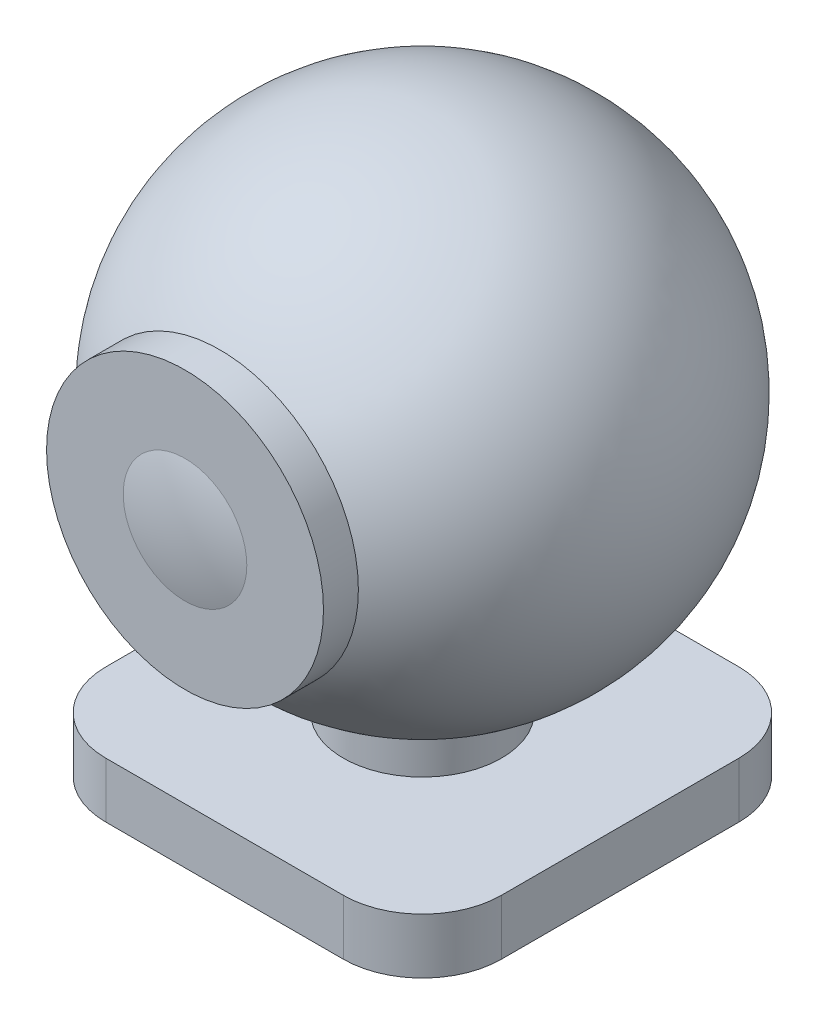
ISO-10303-21;
HEADER;
FILE_DESCRIPTION(('STEP AP214'),'2;1');
FILE_NAME('part.step','',(''),(''),'','','');
FILE_SCHEMA(('AUTOMOTIVE_DESIGN { 1 0 10303 214 1 1 1 1 }'));
ENDSEC;
DATA;
#1=APPLICATION_CONTEXT('core data for automotive mechanical design processes');
#2=APPLICATION_PROTOCOL_DEFINITION('international standard','automotive_design',2000,#1);
#3=PRODUCT_CONTEXT('',#1,'mechanical');
#4=PRODUCT('Part','Part','',(#3));
#5=PRODUCT_RELATED_PRODUCT_CATEGORY('part','',(#4));
#6=PRODUCT_DEFINITION_FORMATION('','',#4);
#7=PRODUCT_DEFINITION_CONTEXT('part definition',#1,'design');
#8=PRODUCT_DEFINITION('design','',#6,#7);
#9=PRODUCT_DEFINITION_SHAPE('','',#8);
#10=(LENGTH_UNIT() NAMED_UNIT(*) SI_UNIT(.MILLI.,.METRE.));
#11=(NAMED_UNIT(*) PLANE_ANGLE_UNIT() SI_UNIT($,.RADIAN.));
#12=(NAMED_UNIT(*) SI_UNIT($,.STERADIAN.) SOLID_ANGLE_UNIT());
#13=UNCERTAINTY_MEASURE_WITH_UNIT(LENGTH_MEASURE(1.E-05),#10,'distance_accuracy_value','');
#14=(GEOMETRIC_REPRESENTATION_CONTEXT(3) GLOBAL_UNCERTAINTY_ASSIGNED_CONTEXT((#13)) GLOBAL_UNIT_ASSIGNED_CONTEXT((#10,
#11,#12)) REPRESENTATION_CONTEXT('',''));
#15=CARTESIAN_POINT('',(0.,0.,0.));
#16=DIRECTION('',(0.,0.,1.));
#17=DIRECTION('',(1.,0.,0.));
#18=AXIS2_PLACEMENT_3D('',#15,#16,#17);
#19=CARTESIAN_POINT('',(0.,0.,0.));
#20=DIRECTION('',(0.,1.,0.));
#21=DIRECTION('',(-1.,0.,0.));
#22=AXIS2_PLACEMENT_3D('',#19,#20,#21);
#23=SPHERICAL_SURFACE('',#22,31.);
#24=CARTESIAN_POINT('',(0.,0.,25.588083163848));
#25=DIRECTION('',(0.,0.,-1.));
#26=DIRECTION('',(-1.,0.,0.));
#27=AXIS2_PLACEMENT_3D('',#24,#25,#26);
#28=CIRCLE('',#27,17.5);
#29=CARTESIAN_POINT('',(-17.5,0.,25.588083163848));
#30=VERTEX_POINT('',#29);
#31=EDGE_CURVE('E151',#30,#30,#28,.F.);
#32=ORIENTED_EDGE('',*,*,#31,.F.);
#33=EDGE_LOOP('',(#32));
#34=FACE_BOUND('',#33,.T.);
#35=CARTESIAN_POINT('',(0.,-29.3428015022424,0.));
#36=DIRECTION('',(0.,1.,0.));
#37=DIRECTION('',(0.,0.,1.));
#38=AXIS2_PLACEMENT_3D('',#35,#36,#37);
#39=CIRCLE('',#38,10.);
#40=CARTESIAN_POINT('',(0.,-29.3428015022424,10.));
#41=VERTEX_POINT('',#40);
#42=EDGE_CURVE('E148',#41,#41,#39,.F.);
#43=ORIENTED_EDGE('',*,*,#42,.F.);
#44=EDGE_LOOP('',(#43));
#45=FACE_BOUND('',#44,.T.);
#46=ADVANCED_FACE('F33',(#34,#45),#23,.T.);
#47=CARTESIAN_POINT('',(0.,0.,30.));
#48=DIRECTION('',(0.,0.,1.));
#49=DIRECTION('',(1.,0.,0.));
#50=AXIS2_PLACEMENT_3D('',#47,#48,#49);
#51=PLANE('',#50);
#52=CARTESIAN_POINT('',(0.,0.,30.));
#53=DIRECTION('',(0.,0.,1.));
#54=DIRECTION('',(1.,0.,0.));
#55=AXIS2_PLACEMENT_3D('',#52,#53,#54);
#56=CIRCLE('',#55,17.5);
#57=CARTESIAN_POINT('',(17.5,0.,30.));
#58=VERTEX_POINT('',#57);
#59=EDGE_CURVE('E152',#58,#58,#56,.T.);
#60=ORIENTED_EDGE('',*,*,#59,.T.);
#61=EDGE_LOOP('',(#60));
#62=FACE_BOUND('',#61,.T.);
#63=CARTESIAN_POINT('',(0.,0.,30.));
#64=DIRECTION('',(0.,0.,1.));
#65=DIRECTION('',(1.,0.,0.));
#66=AXIS2_PLACEMENT_3D('',#63,#64,#65);
#67=CIRCLE('',#66,7.81024967590665);
#68=CARTESIAN_POINT('',(7.81024967590665,0.,30.));
#69=VERTEX_POINT('',#68);
#70=EDGE_CURVE('E161',#69,#69,#67,.T.);
#71=ORIENTED_EDGE('',*,*,#70,.F.);
#72=EDGE_LOOP('',(#71));
#73=FACE_BOUND('',#72,.T.);
#74=ADVANCED_FACE('F217',(#62,#73),#51,.T.);
#75=CARTESIAN_POINT('',(0.,0.,30.));
#76=DIRECTION('',(0.,0.,-1.));
#77=DIRECTION('',(-1.,0.,0.));
#78=AXIS2_PLACEMENT_3D('',#75,#76,#77);
#79=CYLINDRICAL_SURFACE('',#78,17.5);
#80=ORIENTED_EDGE('',*,*,#59,.F.);
#81=EDGE_LOOP('',(#80));
#82=FACE_BOUND('',#81,.T.);
#83=ORIENTED_EDGE('',*,*,#31,.T.);
#84=EDGE_LOOP('',(#83));
#85=FACE_BOUND('',#84,.T.);
#86=ADVANCED_FACE('F224',(#82,#85),#79,.T.);
#87=CARTESIAN_POINT('',(0.,0.,0.));
#88=DIRECTION('',(0.,0.,1.));
#89=DIRECTION('',(1.,0.,0.));
#90=AXIS2_PLACEMENT_3D('',#87,#88,#89);
#91=SPHERICAL_SURFACE('',#90,31.);
#92=ORIENTED_EDGE('',*,*,#70,.T.);
#93=EDGE_LOOP('',(#92));
#94=FACE_BOUND('',#93,.T.);
#95=ADVANCED_FACE('F220',(#94),#91,.T.);
#96=CARTESIAN_POINT('',(0.,-28.,0.));
#97=DIRECTION('',(0.,-1.,0.));
#98=DIRECTION('',(0.,0.,-1.));
#99=AXIS2_PLACEMENT_3D('',#96,#97,#98);
#100=CYLINDRICAL_SURFACE('',#99,10.);
#101=CARTESIAN_POINT('',(0.,-35.,0.));
#102=DIRECTION('',(0.,-1.,0.));
#103=DIRECTION('',(0.,0.,-1.));
#104=AXIS2_PLACEMENT_3D('',#101,#102,#103);
#105=CIRCLE('',#104,10.);
#106=CARTESIAN_POINT('',(0.,-35.,-10.));
#107=VERTEX_POINT('',#106);
#108=EDGE_CURVE('E141',#107,#107,#105,.T.);
#109=ORIENTED_EDGE('',*,*,#108,.F.);
#110=EDGE_LOOP('',(#109));
#111=FACE_BOUND('',#110,.T.);
#112=ORIENTED_EDGE('',*,*,#42,.T.);
#113=EDGE_LOOP('',(#112));
#114=FACE_BOUND('',#113,.T.);
#115=ADVANCED_FACE('F232',(#111,#114),#100,.T.);
#116=CARTESIAN_POINT('',(25.,-35.,-25.));
#117=DIRECTION('',(0.,-1.,0.));
#118=DIRECTION('',(0.,0.,-1.));
#119=AXIS2_PLACEMENT_3D('',#116,#117,#118);
#120=PLANE('',#119);
#121=DIRECTION('',(0.,0.,1.));
#122=VECTOR('',#121,1.);
#123=CARTESIAN_POINT('',(25.,-35.,25.));
#124=LINE('',#123,#122);
#125=CARTESIAN_POINT('',(25.,-35.,-15.));
#126=VERTEX_POINT('',#125);
#127=CARTESIAN_POINT('',(25.,-35.,15.));
#128=VERTEX_POINT('',#127);
#129=EDGE_CURVE('E118',#126,#128,#124,.T.);
#130=ORIENTED_EDGE('',*,*,#129,.F.);
#131=CARTESIAN_POINT('',(15.,-35.,-15.));
#132=DIRECTION('',(0.,-1.,0.));
#133=DIRECTION('',(0.,0.,-1.));
#134=AXIS2_PLACEMENT_3D('',#131,#132,#133);
#135=CIRCLE('',#134,10.);
#136=CARTESIAN_POINT('',(15.,-35.,-25.));
#137=VERTEX_POINT('',#136);
#138=EDGE_CURVE('E101',#126,#137,#135,.F.);
#139=ORIENTED_EDGE('',*,*,#138,.T.);
#140=DIRECTION('',(1.,0.,0.));
#141=VECTOR('',#140,1.);
#142=CARTESIAN_POINT('',(-25.,-35.,-25.));
#143=LINE('',#142,#141);
#144=CARTESIAN_POINT('',(-15.,-35.,-25.));
#145=VERTEX_POINT('',#144);
#146=EDGE_CURVE('E139',#145,#137,#143,.T.);
#147=ORIENTED_EDGE('',*,*,#146,.F.);
#148=CARTESIAN_POINT('',(-15.,-35.,-15.));
#149=DIRECTION('',(0.,-1.,0.));
#150=DIRECTION('',(0.,0.,-1.));
#151=AXIS2_PLACEMENT_3D('',#148,#149,#150);
#152=CIRCLE('',#151,10.);
#153=CARTESIAN_POINT('',(-25.,-35.,-15.));
#154=VERTEX_POINT('',#153);
#155=EDGE_CURVE('E112',#145,#154,#152,.F.);
#156=ORIENTED_EDGE('',*,*,#155,.T.);
#157=DIRECTION('',(0.,0.,-1.));
#158=VECTOR('',#157,1.);
#159=CARTESIAN_POINT('',(-25.,-35.,25.));
#160=LINE('',#159,#158);
#161=CARTESIAN_POINT('',(-25.,-35.,15.));
#162=VERTEX_POINT('',#161);
#163=EDGE_CURVE('E132',#162,#154,#160,.T.);
#164=ORIENTED_EDGE('',*,*,#163,.F.);
#165=CARTESIAN_POINT('',(-15.,-35.,15.));
#166=DIRECTION('',(0.,-1.,0.));
#167=DIRECTION('',(0.,0.,-1.));
#168=AXIS2_PLACEMENT_3D('',#165,#166,#167);
#169=CIRCLE('',#168,10.);
#170=CARTESIAN_POINT('',(-15.,-35.,25.));
#171=VERTEX_POINT('',#170);
#172=EDGE_CURVE('E122',#162,#171,#169,.F.);
#173=ORIENTED_EDGE('',*,*,#172,.T.);
#174=DIRECTION('',(-1.,0.,0.));
#175=VECTOR('',#174,1.);
#176=CARTESIAN_POINT('',(-25.,-35.,25.));
#177=LINE('',#176,#175);
#178=CARTESIAN_POINT('',(15.,-35.,25.));
#179=VERTEX_POINT('',#178);
#180=EDGE_CURVE('E129',#179,#171,#177,.T.);
#181=ORIENTED_EDGE('',*,*,#180,.F.);
#182=CARTESIAN_POINT('',(15.,-35.,15.));
#183=DIRECTION('',(0.,-1.,0.));
#184=DIRECTION('',(0.,0.,-1.));
#185=AXIS2_PLACEMENT_3D('',#182,#183,#184);
#186=CIRCLE('',#185,10.);
#187=EDGE_CURVE('E128',#179,#128,#186,.F.);
#188=ORIENTED_EDGE('',*,*,#187,.T.);
#189=EDGE_LOOP('',(#130,#139,#147,#156,#164,#173,#181,#188));
#190=FACE_BOUND('',#189,.T.);
#191=ORIENTED_EDGE('',*,*,#108,.T.);
#192=EDGE_LOOP('',(#191));
#193=FACE_BOUND('',#192,.T.);
#194=ADVANCED_FACE('F125',(#190,#193),#120,.F.);
#195=CARTESIAN_POINT('',(25.,-42.,25.));
#196=DIRECTION('',(-1.,0.,0.));
#197=DIRECTION('',(0.,0.,1.));
#198=AXIS2_PLACEMENT_3D('',#195,#196,#197);
#199=PLANE('',#198);
#200=DIRECTION('',(0.,0.,1.));
#201=VECTOR('',#200,1.);
#202=CARTESIAN_POINT('',(25.,-42.,25.));
#203=LINE('',#202,#201);
#204=CARTESIAN_POINT('',(25.,-42.,-15.));
#205=VERTEX_POINT('',#204);
#206=CARTESIAN_POINT('',(25.,-42.,15.));
#207=VERTEX_POINT('',#206);
#208=EDGE_CURVE('E121',#205,#207,#203,.T.);
#209=ORIENTED_EDGE('',*,*,#208,.F.);
#210=DIRECTION('',(0.,1.,0.));
#211=VECTOR('',#210,1.);
#212=CARTESIAN_POINT('',(25.,-42.,-15.));
#213=LINE('',#212,#211);
#214=EDGE_CURVE('E105',#205,#126,#213,.T.);
#215=ORIENTED_EDGE('',*,*,#214,.T.);
#216=ORIENTED_EDGE('',*,*,#129,.T.);
#217=DIRECTION('',(0.,1.,0.));
#218=VECTOR('',#217,1.);
#219=CARTESIAN_POINT('',(25.,-42.,15.));
#220=LINE('',#219,#218);
#221=EDGE_CURVE('E123',#128,#207,#220,.F.);
#222=ORIENTED_EDGE('',*,*,#221,.T.);
#223=EDGE_LOOP('',(#209,#215,#216,#222));
#224=FACE_BOUND('',#223,.T.);
#225=ADVANCED_FACE('F117',(#224),#199,.F.);
#226=CARTESIAN_POINT('',(-25.,-42.,25.));
#227=DIRECTION('',(0.,0.,-1.));
#228=DIRECTION('',(-1.,0.,0.));
#229=AXIS2_PLACEMENT_3D('',#226,#227,#228);
#230=PLANE('',#229);
#231=DIRECTION('',(-1.,0.,0.));
#232=VECTOR('',#231,1.);
#233=CARTESIAN_POINT('',(-25.,-42.,25.));
#234=LINE('',#233,#232);
#235=CARTESIAN_POINT('',(15.,-42.,25.));
#236=VERTEX_POINT('',#235);
#237=CARTESIAN_POINT('',(-15.,-42.,25.));
#238=VERTEX_POINT('',#237);
#239=EDGE_CURVE('E189',#236,#238,#234,.T.);
#240=ORIENTED_EDGE('',*,*,#239,.F.);
#241=DIRECTION('',(0.,1.,0.));
#242=VECTOR('',#241,1.);
#243=CARTESIAN_POINT('',(15.,-42.,25.));
#244=LINE('',#243,#242);
#245=EDGE_CURVE('E12',#236,#179,#244,.T.);
#246=ORIENTED_EDGE('',*,*,#245,.T.);
#247=ORIENTED_EDGE('',*,*,#180,.T.);
#248=DIRECTION('',(0.,1.,0.));
#249=VECTOR('',#248,1.);
#250=CARTESIAN_POINT('',(-15.,-42.,25.));
#251=LINE('',#250,#249);
#252=EDGE_CURVE('E42',#171,#238,#251,.F.);
#253=ORIENTED_EDGE('',*,*,#252,.T.);
#254=EDGE_LOOP('',(#240,#246,#247,#253));
#255=FACE_BOUND('',#254,.T.);
#256=ADVANCED_FACE('F188',(#255),#230,.F.);
#257=CARTESIAN_POINT('',(-25.,-42.,25.));
#258=DIRECTION('',(1.,0.,0.));
#259=DIRECTION('',(0.,0.,-1.));
#260=AXIS2_PLACEMENT_3D('',#257,#258,#259);
#261=PLANE('',#260);
#262=ORIENTED_EDGE('',*,*,#163,.T.);
#263=DIRECTION('',(0.,1.,0.));
#264=VECTOR('',#263,1.);
#265=CARTESIAN_POINT('',(-25.,-42.,-15.));
#266=LINE('',#265,#264);
#267=CARTESIAN_POINT('',(-25.,-42.,-15.));
#268=VERTEX_POINT('',#267);
#269=EDGE_CURVE('E49',#154,#268,#266,.F.);
#270=ORIENTED_EDGE('',*,*,#269,.T.);
#271=DIRECTION('',(0.,0.,-1.));
#272=VECTOR('',#271,1.);
#273=CARTESIAN_POINT('',(-25.,-42.,25.));
#274=LINE('',#273,#272);
#275=CARTESIAN_POINT('',(-25.,-42.,15.));
#276=VERTEX_POINT('',#275);
#277=EDGE_CURVE('E195',#276,#268,#274,.T.);
#278=ORIENTED_EDGE('',*,*,#277,.F.);
#279=DIRECTION('',(0.,1.,0.));
#280=VECTOR('',#279,1.);
#281=CARTESIAN_POINT('',(-25.,-42.,15.));
#282=LINE('',#281,#280);
#283=EDGE_CURVE('E182',#276,#162,#282,.T.);
#284=ORIENTED_EDGE('',*,*,#283,.T.);
#285=EDGE_LOOP('',(#262,#270,#278,#284));
#286=FACE_BOUND('',#285,.T.);
#287=ADVANCED_FACE('F199',(#286),#261,.F.);
#288=CARTESIAN_POINT('',(-25.,-42.,-25.));
#289=DIRECTION('',(0.,0.,1.));
#290=DIRECTION('',(1.,0.,0.));
#291=AXIS2_PLACEMENT_3D('',#288,#289,#290);
#292=PLANE('',#291);
#293=ORIENTED_EDGE('',*,*,#146,.T.);
#294=DIRECTION('',(0.,1.,0.));
#295=VECTOR('',#294,1.);
#296=CARTESIAN_POINT('',(15.,-42.,-25.));
#297=LINE('',#296,#295);
#298=CARTESIAN_POINT('',(15.,-42.,-25.));
#299=VERTEX_POINT('',#298);
#300=EDGE_CURVE('E106',#137,#299,#297,.F.);
#301=ORIENTED_EDGE('',*,*,#300,.T.);
#302=DIRECTION('',(1.,0.,0.));
#303=VECTOR('',#302,1.);
#304=CARTESIAN_POINT('',(-25.,-42.,-25.));
#305=LINE('',#304,#303);
#306=CARTESIAN_POINT('',(-15.,-42.,-25.));
#307=VERTEX_POINT('',#306);
#308=EDGE_CURVE('E135',#307,#299,#305,.T.);
#309=ORIENTED_EDGE('',*,*,#308,.F.);
#310=DIRECTION('',(0.,1.,0.));
#311=VECTOR('',#310,1.);
#312=CARTESIAN_POINT('',(-15.,-42.,-25.));
#313=LINE('',#312,#311);
#314=EDGE_CURVE('E111',#307,#145,#313,.T.);
#315=ORIENTED_EDGE('',*,*,#314,.T.);
#316=EDGE_LOOP('',(#293,#301,#309,#315));
#317=FACE_BOUND('',#316,.T.);
#318=ADVANCED_FACE('F206',(#317),#292,.F.);
#319=CARTESIAN_POINT('',(25.,-42.,-25.));
#320=DIRECTION('',(0.,-1.,0.));
#321=DIRECTION('',(0.,0.,-1.));
#322=AXIS2_PLACEMENT_3D('',#319,#320,#321);
#323=PLANE('',#322);
#324=ORIENTED_EDGE('',*,*,#308,.T.);
#325=CARTESIAN_POINT('',(15.,-42.,-15.));
#326=DIRECTION('',(0.,-1.,0.));
#327=DIRECTION('',(0.,0.,-1.));
#328=AXIS2_PLACEMENT_3D('',#325,#326,#327);
#329=CIRCLE('',#328,10.);
#330=EDGE_CURVE('E180',#299,#205,#329,.T.);
#331=ORIENTED_EDGE('',*,*,#330,.T.);
#332=ORIENTED_EDGE('',*,*,#208,.T.);
#333=CARTESIAN_POINT('',(15.,-42.,15.));
#334=DIRECTION('',(0.,-1.,0.));
#335=DIRECTION('',(0.,0.,-1.));
#336=AXIS2_PLACEMENT_3D('',#333,#334,#335);
#337=CIRCLE('',#336,10.);
#338=EDGE_CURVE('E176',#207,#236,#337,.T.);
#339=ORIENTED_EDGE('',*,*,#338,.T.);
#340=ORIENTED_EDGE('',*,*,#239,.T.);
#341=CARTESIAN_POINT('',(-15.,-42.,15.));
#342=DIRECTION('',(0.,-1.,0.));
#343=DIRECTION('',(0.,0.,-1.));
#344=AXIS2_PLACEMENT_3D('',#341,#342,#343);
#345=CIRCLE('',#344,10.);
#346=EDGE_CURVE('E56',#238,#276,#345,.T.);
#347=ORIENTED_EDGE('',*,*,#346,.T.);
#348=ORIENTED_EDGE('',*,*,#277,.T.);
#349=CARTESIAN_POINT('',(-15.,-42.,-15.));
#350=DIRECTION('',(0.,-1.,0.));
#351=DIRECTION('',(0.,0.,-1.));
#352=AXIS2_PLACEMENT_3D('',#349,#350,#351);
#353=CIRCLE('',#352,10.);
#354=EDGE_CURVE('E178',#268,#307,#353,.T.);
#355=ORIENTED_EDGE('',*,*,#354,.T.);
#356=EDGE_LOOP('',(#324,#331,#332,#339,#340,#347,#348,#355));
#357=FACE_BOUND('',#356,.T.);
#358=ADVANCED_FACE('F193',(#357),#323,.T.);
#359=CARTESIAN_POINT('',(15.,-42.,-15.));
#360=DIRECTION('',(0.,1.,0.));
#361=DIRECTION('',(0.,0.,1.));
#362=AXIS2_PLACEMENT_3D('',#359,#360,#361);
#363=CYLINDRICAL_SURFACE('',#362,10.);
#364=ORIENTED_EDGE('',*,*,#330,.F.);
#365=ORIENTED_EDGE('',*,*,#300,.F.);
#366=ORIENTED_EDGE('',*,*,#138,.F.);
#367=ORIENTED_EDGE('',*,*,#214,.F.);
#368=EDGE_LOOP('',(#364,#365,#366,#367));
#369=FACE_BOUND('',#368,.T.);
#370=ADVANCED_FACE('F104',(#369),#363,.T.);
#371=CARTESIAN_POINT('',(-15.,-42.,-15.));
#372=DIRECTION('',(0.,1.,0.));
#373=DIRECTION('',(0.,0.,1.));
#374=AXIS2_PLACEMENT_3D('',#371,#372,#373);
#375=CYLINDRICAL_SURFACE('',#374,10.);
#376=ORIENTED_EDGE('',*,*,#354,.F.);
#377=ORIENTED_EDGE('',*,*,#269,.F.);
#378=ORIENTED_EDGE('',*,*,#155,.F.);
#379=ORIENTED_EDGE('',*,*,#314,.F.);
#380=EDGE_LOOP('',(#376,#377,#378,#379));
#381=FACE_BOUND('',#380,.T.);
#382=ADVANCED_FACE('F203',(#381),#375,.T.);
#383=CARTESIAN_POINT('',(15.,-42.,15.));
#384=DIRECTION('',(0.,1.,0.));
#385=DIRECTION('',(0.,0.,1.));
#386=AXIS2_PLACEMENT_3D('',#383,#384,#385);
#387=CYLINDRICAL_SURFACE('',#386,10.);
#388=ORIENTED_EDGE('',*,*,#338,.F.);
#389=ORIENTED_EDGE('',*,*,#221,.F.);
#390=ORIENTED_EDGE('',*,*,#187,.F.);
#391=ORIENTED_EDGE('',*,*,#245,.F.);
#392=EDGE_LOOP('',(#388,#389,#390,#391));
#393=FACE_BOUND('',#392,.T.);
#394=ADVANCED_FACE('F209',(#393),#387,.T.);
#395=CARTESIAN_POINT('',(-15.,-42.,15.));
#396=DIRECTION('',(0.,1.,0.));
#397=DIRECTION('',(0.,0.,1.));
#398=AXIS2_PLACEMENT_3D('',#395,#396,#397);
#399=CYLINDRICAL_SURFACE('',#398,10.);
#400=ORIENTED_EDGE('',*,*,#346,.F.);
#401=ORIENTED_EDGE('',*,*,#252,.F.);
#402=ORIENTED_EDGE('',*,*,#172,.F.);
#403=ORIENTED_EDGE('',*,*,#283,.F.);
#404=EDGE_LOOP('',(#400,#401,#402,#403));
#405=FACE_BOUND('',#404,.T.);
#406=ADVANCED_FACE('F35',(#405),#399,.T.);
#407=CLOSED_SHELL('',(#46,#74,#86,#95,#115,#194,#225,#256,#287,#318,#358,#370,#382,#394,#406));
#408=CARTESIAN_POINT('',(0.,0.,0.));
#409=DIRECTION('',(0.,1.,0.));
#410=DIRECTION('',(-1.,0.,0.));
#411=AXIS2_PLACEMENT_3D('',#408,#409,#410);
#412=SPHERICAL_SURFACE('',#411,30.);
#413=CARTESIAN_POINT('',(0.,0.,24.3669858620224));
#414=DIRECTION('',(0.,0.,-1.));
#415=DIRECTION('',(-1.,0.,0.));
#416=AXIS2_PLACEMENT_3D('',#413,#414,#415);
#417=CIRCLE('',#416,17.5);
#418=CARTESIAN_POINT('',(-17.5,0.,24.3669858620224));
#419=VERTEX_POINT('',#418);
#420=EDGE_CURVE('E155',#419,#419,#417,.F.);
#421=ORIENTED_EDGE('',*,*,#420,.T.);
#422=EDGE_LOOP('',(#421));
#423=FACE_BOUND('',#422,.T.);
#424=CARTESIAN_POINT('',(0.,-28.2842712474619,0.));
#425=DIRECTION('',(0.,1.,0.));
#426=DIRECTION('',(0.,0.,1.));
#427=AXIS2_PLACEMENT_3D('',#424,#425,#426);
#428=CIRCLE('',#427,10.);
#429=CARTESIAN_POINT('',(0.,-28.2842712474619,10.));
#430=VERTEX_POINT('',#429);
#431=EDGE_CURVE('E147',#430,#430,#428,.F.);
#432=ORIENTED_EDGE('',*,*,#431,.T.);
#433=EDGE_LOOP('',(#432));
#434=FACE_BOUND('',#433,.T.);
#435=ADVANCED_FACE('F253',(#423,#434),#412,.F.);
#436=ORIENTED_EDGE('',*,*,#420,.F.);
#437=EDGE_LOOP('',(#436));
#438=FACE_BOUND('',#437,.T.);
#439=CARTESIAN_POINT('',(0.,0.,20.));
#440=DIRECTION('',(0.,0.,1.));
#441=DIRECTION('',(1.,0.,0.));
#442=AXIS2_PLACEMENT_3D('',#439,#440,#441);
#443=CIRCLE('',#442,17.5);
#444=CARTESIAN_POINT('',(17.5,0.,20.));
#445=VERTEX_POINT('',#444);
#446=EDGE_CURVE('E156',#445,#445,#443,.T.);
#447=ORIENTED_EDGE('',*,*,#446,.T.);
#448=EDGE_LOOP('',(#447));
#449=FACE_BOUND('',#448,.T.);
#450=ADVANCED_FACE('F243',(#438,#449),#79,.T.);
#451=CARTESIAN_POINT('',(0.,0.,20.));
#452=DIRECTION('',(0.,0.,1.));
#453=DIRECTION('',(1.,0.,0.));
#454=AXIS2_PLACEMENT_3D('',#451,#452,#453);
#455=PLANE('',#454);
#456=ORIENTED_EDGE('',*,*,#446,.F.);
#457=EDGE_LOOP('',(#456));
#458=FACE_BOUND('',#457,.T.);
#459=ADVANCED_FACE('F252',(#458),#455,.F.);
#460=CARTESIAN_POINT('',(-34.2835569799683,-28.,0.));
#461=DIRECTION('',(0.,1.,0.));
#462=DIRECTION('',(0.,0.,1.));
#463=AXIS2_PLACEMENT_3D('',#460,#461,#462);
#464=PLANE('',#463);
#465=CARTESIAN_POINT('',(0.,-28.,0.));
#466=DIRECTION('',(0.,1.,0.));
#467=DIRECTION('',(0.,0.,1.));
#468=AXIS2_PLACEMENT_3D('',#465,#466,#467);
#469=CIRCLE('',#468,10.);
#470=CARTESIAN_POINT('',(0.,-28.,10.));
#471=VERTEX_POINT('',#470);
#472=EDGE_CURVE('E144',#471,#471,#469,.T.);
#473=ORIENTED_EDGE('',*,*,#472,.T.);
#474=EDGE_LOOP('',(#473));
#475=FACE_BOUND('',#474,.T.);
#476=ADVANCED_FACE('F260',(#475),#464,.T.);
#477=ORIENTED_EDGE('',*,*,#431,.F.);
#478=EDGE_LOOP('',(#477));
#479=FACE_BOUND('',#478,.T.);
#480=ORIENTED_EDGE('',*,*,#472,.F.);
#481=EDGE_LOOP('',(#480));
#482=FACE_BOUND('',#481,.T.);
#483=ADVANCED_FACE('F240',(#479,#482),#100,.T.);
#484=CLOSED_SHELL('',(#435,#450,#459,#476,#483));
#485=ORIENTED_CLOSED_SHELL('',*,#484,.T.);
#486=BREP_WITH_VOIDS('B2',#407,(#485));
#487=ADVANCED_BREP_SHAPE_REPRESENTATION('',(#18,#486),#14);
#488=SHAPE_DEFINITION_REPRESENTATION(#9,#487);
ENDSEC;
END-ISO-10303-21;
